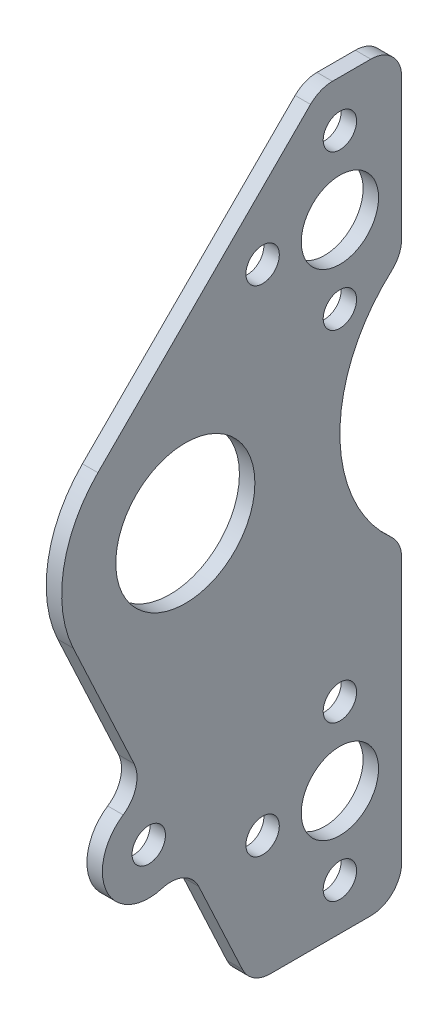
ISO-10303-21;
HEADER;
FILE_DESCRIPTION(('STEP AP214'),'2;1');
FILE_NAME('part.step','',(''),(''),'','','');
FILE_SCHEMA(('AUTOMOTIVE_DESIGN { 1 0 10303 214 1 1 1 1 }'));
ENDSEC;
DATA;
#1=APPLICATION_CONTEXT('core data for automotive mechanical design processes');
#2=APPLICATION_PROTOCOL_DEFINITION('international standard','automotive_design',2000,#1);
#3=PRODUCT_CONTEXT('',#1,'mechanical');
#4=PRODUCT('Part','Part','',(#3));
#5=PRODUCT_RELATED_PRODUCT_CATEGORY('part','',(#4));
#6=PRODUCT_DEFINITION_FORMATION('','',#4);
#7=PRODUCT_DEFINITION_CONTEXT('part definition',#1,'design');
#8=PRODUCT_DEFINITION('design','',#6,#7);
#9=PRODUCT_DEFINITION_SHAPE('','',#8);
#10=(LENGTH_UNIT() NAMED_UNIT(*) SI_UNIT(.MILLI.,.METRE.));
#11=(NAMED_UNIT(*) PLANE_ANGLE_UNIT() SI_UNIT($,.RADIAN.));
#12=(NAMED_UNIT(*) SI_UNIT($,.STERADIAN.) SOLID_ANGLE_UNIT());
#13=UNCERTAINTY_MEASURE_WITH_UNIT(LENGTH_MEASURE(1.E-05),#10,'distance_accuracy_value','');
#14=(GEOMETRIC_REPRESENTATION_CONTEXT(3) GLOBAL_UNCERTAINTY_ASSIGNED_CONTEXT((#13)) GLOBAL_UNIT_ASSIGNED_CONTEXT((#10,
#11,#12)) REPRESENTATION_CONTEXT('',''));
#15=CARTESIAN_POINT('',(0.,0.,0.));
#16=DIRECTION('',(0.,0.,1.));
#17=DIRECTION('',(1.,0.,0.));
#18=AXIS2_PLACEMENT_3D('',#15,#16,#17);
#19=CARTESIAN_POINT('',(3.175,-68.6728859953783,22.0595562798087));
#20=DIRECTION('',(1.,0.,0.));
#21=DIRECTION('',(0.,0.,-1.));
#22=AXIS2_PLACEMENT_3D('',#19,#20,#21);
#23=PLANE('',#22);
#24=CARTESIAN_POINT('',(3.175,-47.625,-12.7));
#25=DIRECTION('',(1.,0.,0.));
#26=DIRECTION('',(0.,0.,-1.));
#27=AXIS2_PLACEMENT_3D('',#24,#25,#26);
#28=CIRCLE('',#27,3.429);
#29=CARTESIAN_POINT('',(3.175,-47.625,-16.129));
#30=VERTEX_POINT('',#29);
#31=EDGE_CURVE('E456',#30,#30,#28,.T.);
#32=ORIENTED_EDGE('',*,*,#31,.F.);
#33=EDGE_LOOP('',(#32));
#34=FACE_BOUND('',#33,.T.);
#35=CARTESIAN_POINT('',(3.175,22.225,-12.7000000000002));
#36=DIRECTION('',(1.,0.,0.));
#37=DIRECTION('',(0.,0.,-1.));
#38=AXIS2_PLACEMENT_3D('',#35,#36,#37);
#39=CIRCLE('',#38,3.42899999999915);
#40=CARTESIAN_POINT('',(3.175,22.225,-16.1289999999993));
#41=VERTEX_POINT('',#40);
#42=EDGE_CURVE('E472',#41,#41,#39,.T.);
#43=ORIENTED_EDGE('',*,*,#42,.F.);
#44=EDGE_LOOP('',(#43));
#45=FACE_BOUND('',#44,.T.);
#46=CARTESIAN_POINT('',(3.175,53.9750000000001,-12.7000000000001));
#47=DIRECTION('',(1.,0.,0.));
#48=DIRECTION('',(0.,0.,-1.));
#49=AXIS2_PLACEMENT_3D('',#46,#47,#48);
#50=CIRCLE('',#49,3.42899999999915);
#51=CARTESIAN_POINT('',(3.175,53.9750000000001,-16.1289999999992));
#52=VERTEX_POINT('',#51);
#53=EDGE_CURVE('E488',#52,#52,#50,.T.);
#54=ORIENTED_EDGE('',*,*,#53,.F.);
#55=EDGE_LOOP('',(#54));
#56=FACE_BOUND('',#55,.T.);
#57=CARTESIAN_POINT('',(3.175,-63.5,-12.7));
#58=DIRECTION('',(1.,0.,0.));
#59=DIRECTION('',(0.,0.,-1.));
#60=AXIS2_PLACEMENT_3D('',#57,#58,#59);
#61=CIRCLE('',#60,7.93750000000001);
#62=CARTESIAN_POINT('',(3.175,-63.5,-20.6375));
#63=VERTEX_POINT('',#62);
#64=EDGE_CURVE('E504',#63,#63,#61,.T.);
#65=ORIENTED_EDGE('',*,*,#64,.F.);
#66=EDGE_LOOP('',(#65));
#67=FACE_BOUND('',#66,.T.);
#68=CARTESIAN_POINT('',(3.175,0.,19.05));
#69=DIRECTION('',(1.,0.,0.));
#70=DIRECTION('',(0.,0.,-1.));
#71=AXIS2_PLACEMENT_3D('',#68,#69,#70);
#72=CIRCLE('',#71,14.2875);
#73=CARTESIAN_POINT('',(3.175,0.,4.76250000000001));
#74=VERTEX_POINT('',#73);
#75=EDGE_CURVE('E210',#74,#74,#72,.T.);
#76=ORIENTED_EDGE('',*,*,#75,.F.);
#77=EDGE_LOOP('',(#76));
#78=FACE_BOUND('',#77,.T.);
#79=CARTESIAN_POINT('',(3.175,-68.6728859953783,22.0595562798087));
#80=DIRECTION('',(-1.,0.,0.));
#81=DIRECTION('',(0.,0.,-1.));
#82=AXIS2_PLACEMENT_3D('',#79,#80,#81);
#83=CIRCLE('',#82,6.35);
#84=CARTESIAN_POINT('',(3.175,-62.5836192013575,23.8604810176131));
#85=VERTEX_POINT('',#84);
#86=CARTESIAN_POINT('',(3.175,-65.9892600333248,16.304501832126));
#87=VERTEX_POINT('',#86);
#88=EDGE_CURVE('E258',#85,#87,#83,.T.);
#89=ORIENTED_EDGE('',*,*,#88,.T.);
#90=DIRECTION('',(0.,-0.906307787036648,-0.422618261740704));
#91=VECTOR('',#90,1.);
#92=CARTESIAN_POINT('',(3.175,-65.9892600333248,16.304501832126));
#93=LINE('',#92,#91);
#94=CARTESIAN_POINT('',(3.175,-85.2336259620534,7.33070662322261));
#95=VERTEX_POINT('',#94);
#96=EDGE_CURVE('E134',#87,#95,#93,.T.);
#97=ORIENTED_EDGE('',*,*,#96,.T.);
#98=CARTESIAN_POINT('',(3.175,-82.55,1.57565217553989));
#99=DIRECTION('',(1.,0.,0.));
#100=DIRECTION('',(0.,0.,-1.));
#101=AXIS2_PLACEMENT_3D('',#98,#99,#100);
#102=CIRCLE('',#101,6.34999999999999);
#103=CARTESIAN_POINT('',(3.175,-88.9,1.57565217553985));
#104=VERTEX_POINT('',#103);
#105=EDGE_CURVE('E319',#95,#104,#102,.T.);
#106=ORIENTED_EDGE('',*,*,#105,.T.);
#107=DIRECTION('',(0.,0.,-1.));
#108=VECTOR('',#107,1.);
#109=CARTESIAN_POINT('',(3.175,-88.9,-19.05));
#110=LINE('',#109,#108);
#111=CARTESIAN_POINT('',(3.175,-88.9,-19.05));
#112=VERTEX_POINT('',#111);
#113=EDGE_CURVE('E339',#104,#112,#110,.T.);
#114=ORIENTED_EDGE('',*,*,#113,.T.);
#115=CARTESIAN_POINT('',(3.175,-82.55,-19.05));
#116=DIRECTION('',(1.,0.,0.));
#117=DIRECTION('',(0.,0.,1.));
#118=AXIS2_PLACEMENT_3D('',#115,#116,#117);
#119=CIRCLE('',#118,6.35);
#120=CARTESIAN_POINT('',(3.175,-82.55,-25.4));
#121=VERTEX_POINT('',#120);
#122=EDGE_CURVE('E335',#112,#121,#119,.T.);
#123=ORIENTED_EDGE('',*,*,#122,.T.);
#124=DIRECTION('',(0.,1.,0.));
#125=VECTOR('',#124,1.);
#126=CARTESIAN_POINT('',(3.175,-28.3980633142473,-25.4));
#127=LINE('',#126,#125);
#128=CARTESIAN_POINT('',(3.175,-28.3980633142473,-25.4));
#129=VERTEX_POINT('',#128);
#130=EDGE_CURVE('E338',#121,#129,#127,.T.);
#131=ORIENTED_EDGE('',*,*,#130,.T.);
#132=CARTESIAN_POINT('',(3.175,-28.3980633142473,-19.05));
#133=DIRECTION('',(1.,0.,0.));
#134=DIRECTION('',(0.,0.,-1.));
#135=AXIS2_PLACEMENT_3D('',#132,#133,#134);
#136=CIRCLE('',#135,6.35);
#137=CARTESIAN_POINT('',(3.175,-23.6650527618728,-23.2833333333333));
#138=VERTEX_POINT('',#137);
#139=EDGE_CURVE('E343',#129,#138,#136,.T.);
#140=ORIENTED_EDGE('',*,*,#139,.T.);
#141=CARTESIAN_POINT('',(3.175,0.,-44.45));
#142=DIRECTION('',(-1.,0.,0.));
#143=DIRECTION('',(0.,0.,-1.));
#144=AXIS2_PLACEMENT_3D('',#141,#142,#143);
#145=CIRCLE('',#144,31.75);
#146=CARTESIAN_POINT('',(3.175,23.6650527618728,-23.2833333333333));
#147=VERTEX_POINT('',#146);
#148=EDGE_CURVE('E350',#138,#147,#145,.T.);
#149=ORIENTED_EDGE('',*,*,#148,.T.);
#150=CARTESIAN_POINT('',(3.175,28.3980633142473,-19.05));
#151=DIRECTION('',(1.,0.,0.));
#152=DIRECTION('',(0.,0.,1.));
#153=AXIS2_PLACEMENT_3D('',#150,#151,#152);
#154=CIRCLE('',#153,6.35);
#155=CARTESIAN_POINT('',(3.175,28.3980633142473,-25.4));
#156=VERTEX_POINT('',#155);
#157=EDGE_CURVE('E353',#147,#156,#154,.T.);
#158=ORIENTED_EDGE('',*,*,#157,.T.);
#159=DIRECTION('',(0.,1.,0.));
#160=VECTOR('',#159,1.);
#161=CARTESIAN_POINT('',(3.175,57.15,-25.4));
#162=LINE('',#161,#160);
#163=CARTESIAN_POINT('',(3.175,57.15,-25.4));
#164=VERTEX_POINT('',#163);
#165=EDGE_CURVE('E356',#156,#164,#162,.T.);
#166=ORIENTED_EDGE('',*,*,#165,.T.);
#167=CARTESIAN_POINT('',(3.175,57.15,-19.05));
#168=DIRECTION('',(1.,0.,0.));
#169=DIRECTION('',(0.,0.,-1.));
#170=AXIS2_PLACEMENT_3D('',#167,#168,#169);
#171=CIRCLE('',#170,6.35);
#172=CARTESIAN_POINT('',(3.175,63.5,-19.05));
#173=VERTEX_POINT('',#172);
#174=EDGE_CURVE('E359',#164,#173,#171,.T.);
#175=ORIENTED_EDGE('',*,*,#174,.T.);
#176=DIRECTION('',(0.,0.,1.));
#177=VECTOR('',#176,1.);
#178=CARTESIAN_POINT('',(3.175,63.5,-11.159231636793));
#179=LINE('',#178,#177);
#180=CARTESIAN_POINT('',(3.175,63.5,-11.159231636793));
#181=VERTEX_POINT('',#180);
#182=EDGE_CURVE('E362',#173,#181,#179,.T.);
#183=ORIENTED_EDGE('',*,*,#182,.T.);
#184=CARTESIAN_POINT('',(3.175,57.15,-11.159231636793));
#185=DIRECTION('',(1.,0.,0.));
#186=DIRECTION('',(0.,0.,1.));
#187=AXIS2_PLACEMENT_3D('',#184,#185,#186);
#188=CIRCLE('',#187,6.35000000000001);
#189=CARTESIAN_POINT('',(3.175,61.6401280605346,-6.66910357625844));
#190=VERTEX_POINT('',#189);
#191=EDGE_CURVE('E365',#181,#190,#188,.T.);
#192=ORIENTED_EDGE('',*,*,#191,.T.);
#193=DIRECTION('',(0.,-0.707106781186544,0.707106781186551));
#194=VECTOR('',#193,1.);
#195=CARTESIAN_POINT('',(3.175,17.9605122421384,37.0105122421382));
#196=LINE('',#195,#194);
#197=CARTESIAN_POINT('',(3.175,17.9605122421384,37.0105122421382));
#198=VERTEX_POINT('',#197);
#199=EDGE_CURVE('E368',#190,#198,#196,.T.);
#200=ORIENTED_EDGE('',*,*,#199,.T.);
#201=CARTESIAN_POINT('',(3.175,0.,19.05));
#202=DIRECTION('',(1.,0.,0.));
#203=DIRECTION('',(0.,0.,-1.));
#204=AXIS2_PLACEMENT_3D('',#201,#202,#203);
#205=CIRCLE('',#204,25.4);
#206=CARTESIAN_POINT('',(3.175,-10.7345038482139,42.0702177907309));
#207=VERTEX_POINT('',#206);
#208=EDGE_CURVE('E183',#198,#207,#205,.T.);
#209=ORIENTED_EDGE('',*,*,#208,.T.);
#210=DIRECTION('',(0.,-0.906307787036648,-0.422618261740704));
#211=VECTOR('',#210,1.);
#212=CARTESIAN_POINT('',(3.175,-10.7345038482139,42.0702177907309));
#213=LINE('',#212,#211);
#214=CARTESIAN_POINT('',(3.175,-37.531858960416,29.5744058836119));
#215=VERTEX_POINT('',#214);
#216=EDGE_CURVE('E177',#207,#215,#213,.T.);
#217=ORIENTED_EDGE('',*,*,#216,.T.);
#218=CARTESIAN_POINT('',(3.175,-40.2154849224695,35.3294603312946));
#219=DIRECTION('',(-1.,0.,0.));
#220=DIRECTION('',(0.,0.,-1.));
#221=AXIS2_PLACEMENT_3D('',#218,#219,#220);
#222=CIRCLE('',#221,6.35);
#223=CARTESIAN_POINT('',(3.175,-45.5091785576122,31.8224234485046));
#224=VERTEX_POINT('',#223);
#225=EDGE_CURVE('E181',#215,#224,#222,.T.);
#226=ORIENTED_EDGE('',*,*,#225,.T.);
#227=CARTESIAN_POINT('',(3.175,-53.4497190103263,26.5618681243196));
#228=DIRECTION('',(1.,0.,0.));
#229=DIRECTION('',(0.,0.,-1.));
#230=AXIS2_PLACEMENT_3D('',#227,#228,#229);
#231=CIRCLE('',#230,9.525);
#232=EDGE_CURVE('E61',#224,#85,#231,.T.);
#233=ORIENTED_EDGE('',*,*,#232,.T.);
#234=EDGE_LOOP('',(#89,#97,#106,#114,#123,#131,#140,#149,#158,#166,#175,#183,#192,#200,#209,
#217,#226,#233));
#235=FACE_BOUND('',#234,.T.);
#236=CARTESIAN_POINT('',(3.175,38.1000000000001,-12.7));
#237=DIRECTION('',(1.,0.,0.));
#238=DIRECTION('',(0.,0.,-1.));
#239=AXIS2_PLACEMENT_3D('',#236,#237,#238);
#240=CIRCLE('',#239,7.93750000000001);
#241=CARTESIAN_POINT('',(3.175,38.1000000000001,-20.6375));
#242=VERTEX_POINT('',#241);
#243=EDGE_CURVE('E512',#242,#242,#240,.T.);
#244=ORIENTED_EDGE('',*,*,#243,.F.);
#245=EDGE_LOOP('',(#244));
#246=FACE_BOUND('',#245,.T.);
#247=CARTESIAN_POINT('',(3.175,-53.4497190103263,26.5618681243196));
#248=DIRECTION('',(1.,0.,0.));
#249=DIRECTION('',(0.,0.,-1.));
#250=AXIS2_PLACEMENT_3D('',#247,#248,#249);
#251=CIRCLE('',#250,3.429);
#252=CARTESIAN_POINT('',(3.175,-53.4497190103263,23.1328681243196));
#253=VERTEX_POINT('',#252);
#254=EDGE_CURVE('E496',#253,#253,#251,.T.);
#255=ORIENTED_EDGE('',*,*,#254,.F.);
#256=EDGE_LOOP('',(#255));
#257=FACE_BOUND('',#256,.T.);
#258=CARTESIAN_POINT('',(3.175,38.1,3.17500000000001));
#259=DIRECTION('',(1.,0.,0.));
#260=DIRECTION('',(0.,0.,-1.));
#261=AXIS2_PLACEMENT_3D('',#258,#259,#260);
#262=CIRCLE('',#261,3.42899999999915);
#263=CARTESIAN_POINT('',(3.175,38.1,-0.253999999999145));
#264=VERTEX_POINT('',#263);
#265=EDGE_CURVE('E480',#264,#264,#262,.T.);
#266=ORIENTED_EDGE('',*,*,#265,.F.);
#267=EDGE_LOOP('',(#266));
#268=FACE_BOUND('',#267,.T.);
#269=CARTESIAN_POINT('',(3.175,-63.5,3.17499999999996));
#270=DIRECTION('',(1.,0.,0.));
#271=DIRECTION('',(0.,0.,-1.));
#272=AXIS2_PLACEMENT_3D('',#269,#270,#271);
#273=CIRCLE('',#272,3.429);
#274=CARTESIAN_POINT('',(3.175,-63.5,-0.25400000000004));
#275=VERTEX_POINT('',#274);
#276=EDGE_CURVE('E464',#275,#275,#273,.T.);
#277=ORIENTED_EDGE('',*,*,#276,.F.);
#278=EDGE_LOOP('',(#277));
#279=FACE_BOUND('',#278,.T.);
#280=CARTESIAN_POINT('',(3.175,-79.375,-12.7));
#281=DIRECTION('',(1.,0.,0.));
#282=DIRECTION('',(0.,0.,-1.));
#283=AXIS2_PLACEMENT_3D('',#280,#281,#282);
#284=CIRCLE('',#283,3.42900000000002);
#285=CARTESIAN_POINT('',(3.175,-79.375,-16.129));
#286=VERTEX_POINT('',#285);
#287=EDGE_CURVE('E445',#286,#286,#284,.T.);
#288=ORIENTED_EDGE('',*,*,#287,.F.);
#289=EDGE_LOOP('',(#288));
#290=FACE_BOUND('',#289,.T.);
#291=ADVANCED_FACE('F43',(#34,#45,#56,#67,#78,#235,#246,#257,#268,#279,#290),#23,.T.);
#292=CARTESIAN_POINT('',(0.,-68.6728859953783,22.0595562798087));
#293=DIRECTION('',(1.,0.,0.));
#294=DIRECTION('',(0.,0.,-1.));
#295=AXIS2_PLACEMENT_3D('',#292,#293,#294);
#296=PLANE('',#295);
#297=CARTESIAN_POINT('',(0.,-68.6728859953783,22.0595562798087));
#298=DIRECTION('',(-1.,0.,0.));
#299=DIRECTION('',(0.,0.,-1.));
#300=AXIS2_PLACEMENT_3D('',#297,#298,#299);
#301=CIRCLE('',#300,6.35);
#302=CARTESIAN_POINT('',(0.,-62.5836192013575,23.8604810176131));
#303=VERTEX_POINT('',#302);
#304=CARTESIAN_POINT('',(0.,-65.9892600333248,16.304501832126));
#305=VERTEX_POINT('',#304);
#306=EDGE_CURVE('E205',#303,#305,#301,.T.);
#307=ORIENTED_EDGE('',*,*,#306,.F.);
#308=CARTESIAN_POINT('',(0.,-53.4497190103263,26.5618681243196));
#309=DIRECTION('',(1.,0.,0.));
#310=DIRECTION('',(0.,0.,-1.));
#311=AXIS2_PLACEMENT_3D('',#308,#309,#310);
#312=CIRCLE('',#311,9.525);
#313=CARTESIAN_POINT('',(0.,-45.5091785576122,31.8224234485046));
#314=VERTEX_POINT('',#313);
#315=EDGE_CURVE('E126',#314,#303,#312,.T.);
#316=ORIENTED_EDGE('',*,*,#315,.F.);
#317=CARTESIAN_POINT('',(0.,-40.2154849224695,35.3294603312946));
#318=DIRECTION('',(-1.,0.,0.));
#319=DIRECTION('',(0.,0.,-1.));
#320=AXIS2_PLACEMENT_3D('',#317,#318,#319);
#321=CIRCLE('',#320,6.35);
#322=CARTESIAN_POINT('',(0.,-37.531858960416,29.5744058836119));
#323=VERTEX_POINT('',#322);
#324=EDGE_CURVE('E120',#323,#314,#321,.T.);
#325=ORIENTED_EDGE('',*,*,#324,.F.);
#326=DIRECTION('',(0.,-0.906307787036648,-0.422618261740704));
#327=VECTOR('',#326,1.);
#328=CARTESIAN_POINT('',(0.,-10.7345038482139,42.0702177907309));
#329=LINE('',#328,#327);
#330=CARTESIAN_POINT('',(0.,-10.7345038482139,42.0702177907309));
#331=VERTEX_POINT('',#330);
#332=EDGE_CURVE('E192',#331,#323,#329,.T.);
#333=ORIENTED_EDGE('',*,*,#332,.F.);
#334=CARTESIAN_POINT('',(0.,0.,19.05));
#335=DIRECTION('',(1.,0.,0.));
#336=DIRECTION('',(0.,0.,-1.));
#337=AXIS2_PLACEMENT_3D('',#334,#335,#336);
#338=CIRCLE('',#337,25.4);
#339=CARTESIAN_POINT('',(0.,17.9605122421384,37.0105122421382));
#340=VERTEX_POINT('',#339);
#341=EDGE_CURVE('E249',#340,#331,#338,.T.);
#342=ORIENTED_EDGE('',*,*,#341,.F.);
#343=DIRECTION('',(0.,-0.707106781186544,0.707106781186551));
#344=VECTOR('',#343,1.);
#345=CARTESIAN_POINT('',(0.,17.9605122421384,37.0105122421382));
#346=LINE('',#345,#344);
#347=CARTESIAN_POINT('',(0.,61.6401280605346,-6.66910357625844));
#348=VERTEX_POINT('',#347);
#349=EDGE_CURVE('E246',#348,#340,#346,.T.);
#350=ORIENTED_EDGE('',*,*,#349,.F.);
#351=CARTESIAN_POINT('',(0.,57.15,-11.159231636793));
#352=DIRECTION('',(1.,0.,0.));
#353=DIRECTION('',(0.,0.,1.));
#354=AXIS2_PLACEMENT_3D('',#351,#352,#353);
#355=CIRCLE('',#354,6.35000000000001);
#356=CARTESIAN_POINT('',(0.,63.5,-11.159231636793));
#357=VERTEX_POINT('',#356);
#358=EDGE_CURVE('E243',#357,#348,#355,.T.);
#359=ORIENTED_EDGE('',*,*,#358,.F.);
#360=DIRECTION('',(0.,0.,1.));
#361=VECTOR('',#360,1.);
#362=CARTESIAN_POINT('',(0.,63.5,-11.159231636793));
#363=LINE('',#362,#361);
#364=CARTESIAN_POINT('',(0.,63.5,-19.05));
#365=VERTEX_POINT('',#364);
#366=EDGE_CURVE('E240',#365,#357,#363,.T.);
#367=ORIENTED_EDGE('',*,*,#366,.F.);
#368=CARTESIAN_POINT('',(0.,57.15,-19.05));
#369=DIRECTION('',(1.,0.,0.));
#370=DIRECTION('',(0.,0.,-1.));
#371=AXIS2_PLACEMENT_3D('',#368,#369,#370);
#372=CIRCLE('',#371,6.35);
#373=CARTESIAN_POINT('',(0.,57.15,-25.4));
#374=VERTEX_POINT('',#373);
#375=EDGE_CURVE('E237',#374,#365,#372,.T.);
#376=ORIENTED_EDGE('',*,*,#375,.F.);
#377=DIRECTION('',(0.,1.,0.));
#378=VECTOR('',#377,1.);
#379=CARTESIAN_POINT('',(0.,57.15,-25.4));
#380=LINE('',#379,#378);
#381=CARTESIAN_POINT('',(0.,28.3980633142473,-25.4));
#382=VERTEX_POINT('',#381);
#383=EDGE_CURVE('E234',#382,#374,#380,.T.);
#384=ORIENTED_EDGE('',*,*,#383,.F.);
#385=CARTESIAN_POINT('',(0.,28.3980633142473,-19.05));
#386=DIRECTION('',(1.,0.,0.));
#387=DIRECTION('',(0.,0.,1.));
#388=AXIS2_PLACEMENT_3D('',#385,#386,#387);
#389=CIRCLE('',#388,6.35);
#390=CARTESIAN_POINT('',(0.,23.6650527618728,-23.2833333333333));
#391=VERTEX_POINT('',#390);
#392=EDGE_CURVE('E231',#391,#382,#389,.T.);
#393=ORIENTED_EDGE('',*,*,#392,.F.);
#394=CARTESIAN_POINT('',(0.,0.,-44.45));
#395=DIRECTION('',(-1.,0.,0.));
#396=DIRECTION('',(0.,0.,-1.));
#397=AXIS2_PLACEMENT_3D('',#394,#395,#396);
#398=CIRCLE('',#397,31.75);
#399=CARTESIAN_POINT('',(0.,-23.6650527618728,-23.2833333333333));
#400=VERTEX_POINT('',#399);
#401=EDGE_CURVE('E228',#400,#391,#398,.T.);
#402=ORIENTED_EDGE('',*,*,#401,.F.);
#403=CARTESIAN_POINT('',(0.,-28.3980633142473,-19.05));
#404=DIRECTION('',(1.,0.,0.));
#405=DIRECTION('',(0.,0.,-1.));
#406=AXIS2_PLACEMENT_3D('',#403,#404,#405);
#407=CIRCLE('',#406,6.35);
#408=CARTESIAN_POINT('',(0.,-28.3980633142473,-25.4));
#409=VERTEX_POINT('',#408);
#410=EDGE_CURVE('E225',#409,#400,#407,.T.);
#411=ORIENTED_EDGE('',*,*,#410,.F.);
#412=DIRECTION('',(0.,1.,0.));
#413=VECTOR('',#412,1.);
#414=CARTESIAN_POINT('',(0.,-28.3980633142473,-25.4));
#415=LINE('',#414,#413);
#416=CARTESIAN_POINT('',(0.,-82.55,-25.4));
#417=VERTEX_POINT('',#416);
#418=EDGE_CURVE('E222',#417,#409,#415,.T.);
#419=ORIENTED_EDGE('',*,*,#418,.F.);
#420=CARTESIAN_POINT('',(0.,-82.55,-19.05));
#421=DIRECTION('',(1.,0.,0.));
#422=DIRECTION('',(0.,0.,1.));
#423=AXIS2_PLACEMENT_3D('',#420,#421,#422);
#424=CIRCLE('',#423,6.35);
#425=CARTESIAN_POINT('',(0.,-88.9,-19.05));
#426=VERTEX_POINT('',#425);
#427=EDGE_CURVE('E219',#426,#417,#424,.T.);
#428=ORIENTED_EDGE('',*,*,#427,.F.);
#429=DIRECTION('',(0.,0.,-1.));
#430=VECTOR('',#429,1.);
#431=CARTESIAN_POINT('',(0.,-88.9,-19.05));
#432=LINE('',#431,#430);
#433=CARTESIAN_POINT('',(0.,-88.9,1.57565217553985));
#434=VERTEX_POINT('',#433);
#435=EDGE_CURVE('E216',#434,#426,#432,.T.);
#436=ORIENTED_EDGE('',*,*,#435,.F.);
#437=CARTESIAN_POINT('',(0.,-82.55,1.57565217553989));
#438=DIRECTION('',(1.,0.,0.));
#439=DIRECTION('',(0.,0.,-1.));
#440=AXIS2_PLACEMENT_3D('',#437,#438,#439);
#441=CIRCLE('',#440,6.34999999999999);
#442=CARTESIAN_POINT('',(0.,-85.2336259620534,7.33070662322261));
#443=VERTEX_POINT('',#442);
#444=EDGE_CURVE('E213',#443,#434,#441,.T.);
#445=ORIENTED_EDGE('',*,*,#444,.F.);
#446=DIRECTION('',(0.,-0.906307787036648,-0.422618261740704));
#447=VECTOR('',#446,1.);
#448=CARTESIAN_POINT('',(0.,-65.9892600333248,16.304501832126));
#449=LINE('',#448,#447);
#450=EDGE_CURVE('E209',#305,#443,#449,.T.);
#451=ORIENTED_EDGE('',*,*,#450,.F.);
#452=EDGE_LOOP('',(#307,#316,#325,#333,#342,#350,#359,#367,#376,#384,#393,#402,#411,#419,#428,
#436,#445,#451));
#453=FACE_BOUND('',#452,.T.);
#454=CARTESIAN_POINT('',(0.,0.,19.05));
#455=DIRECTION('',(1.,0.,0.));
#456=DIRECTION('',(0.,0.,-1.));
#457=AXIS2_PLACEMENT_3D('',#454,#455,#456);
#458=CIRCLE('',#457,14.2875);
#459=CARTESIAN_POINT('',(0.,0.,4.76250000000001));
#460=VERTEX_POINT('',#459);
#461=EDGE_CURVE('E516',#460,#460,#458,.T.);
#462=ORIENTED_EDGE('',*,*,#461,.T.);
#463=EDGE_LOOP('',(#462));
#464=FACE_BOUND('',#463,.T.);
#465=CARTESIAN_POINT('',(0.,38.1000000000001,-12.7));
#466=DIRECTION('',(1.,0.,0.));
#467=DIRECTION('',(0.,0.,-1.));
#468=AXIS2_PLACEMENT_3D('',#465,#466,#467);
#469=CIRCLE('',#468,7.93750000000001);
#470=CARTESIAN_POINT('',(0.,38.1000000000001,-20.6375));
#471=VERTEX_POINT('',#470);
#472=EDGE_CURVE('E508',#471,#471,#469,.T.);
#473=ORIENTED_EDGE('',*,*,#472,.T.);
#474=EDGE_LOOP('',(#473));
#475=FACE_BOUND('',#474,.T.);
#476=CARTESIAN_POINT('',(0.,-63.5,-12.7));
#477=DIRECTION('',(1.,0.,0.));
#478=DIRECTION('',(0.,0.,-1.));
#479=AXIS2_PLACEMENT_3D('',#476,#477,#478);
#480=CIRCLE('',#479,7.93750000000001);
#481=CARTESIAN_POINT('',(0.,-63.5,-20.6375));
#482=VERTEX_POINT('',#481);
#483=EDGE_CURVE('E500',#482,#482,#480,.T.);
#484=ORIENTED_EDGE('',*,*,#483,.T.);
#485=EDGE_LOOP('',(#484));
#486=FACE_BOUND('',#485,.T.);
#487=CARTESIAN_POINT('',(0.,-53.4497190103263,26.5618681243196));
#488=DIRECTION('',(1.,0.,0.));
#489=DIRECTION('',(0.,0.,-1.));
#490=AXIS2_PLACEMENT_3D('',#487,#488,#489);
#491=CIRCLE('',#490,3.429);
#492=CARTESIAN_POINT('',(0.,-53.4497190103263,23.1328681243196));
#493=VERTEX_POINT('',#492);
#494=EDGE_CURVE('E492',#493,#493,#491,.T.);
#495=ORIENTED_EDGE('',*,*,#494,.T.);
#496=EDGE_LOOP('',(#495));
#497=FACE_BOUND('',#496,.T.);
#498=CARTESIAN_POINT('',(0.,53.9750000000001,-12.7000000000001));
#499=DIRECTION('',(1.,0.,0.));
#500=DIRECTION('',(0.,0.,-1.));
#501=AXIS2_PLACEMENT_3D('',#498,#499,#500);
#502=CIRCLE('',#501,3.42899999999915);
#503=CARTESIAN_POINT('',(0.,53.9750000000001,-16.1289999999992));
#504=VERTEX_POINT('',#503);
#505=EDGE_CURVE('E484',#504,#504,#502,.T.);
#506=ORIENTED_EDGE('',*,*,#505,.T.);
#507=EDGE_LOOP('',(#506));
#508=FACE_BOUND('',#507,.T.);
#509=CARTESIAN_POINT('',(0.,38.1,3.17500000000001));
#510=DIRECTION('',(1.,0.,0.));
#511=DIRECTION('',(0.,0.,-1.));
#512=AXIS2_PLACEMENT_3D('',#509,#510,#511);
#513=CIRCLE('',#512,3.42899999999915);
#514=CARTESIAN_POINT('',(0.,38.1,-0.253999999999145));
#515=VERTEX_POINT('',#514);
#516=EDGE_CURVE('E476',#515,#515,#513,.T.);
#517=ORIENTED_EDGE('',*,*,#516,.T.);
#518=EDGE_LOOP('',(#517));
#519=FACE_BOUND('',#518,.T.);
#520=CARTESIAN_POINT('',(0.,22.225,-12.7000000000002));
#521=DIRECTION('',(1.,0.,0.));
#522=DIRECTION('',(0.,0.,-1.));
#523=AXIS2_PLACEMENT_3D('',#520,#521,#522);
#524=CIRCLE('',#523,3.42899999999915);
#525=CARTESIAN_POINT('',(0.,22.225,-16.1289999999993));
#526=VERTEX_POINT('',#525);
#527=EDGE_CURVE('E468',#526,#526,#524,.T.);
#528=ORIENTED_EDGE('',*,*,#527,.T.);
#529=EDGE_LOOP('',(#528));
#530=FACE_BOUND('',#529,.T.);
#531=CARTESIAN_POINT('',(0.,-63.5,3.17499999999996));
#532=DIRECTION('',(1.,0.,0.));
#533=DIRECTION('',(0.,0.,-1.));
#534=AXIS2_PLACEMENT_3D('',#531,#532,#533);
#535=CIRCLE('',#534,3.429);
#536=CARTESIAN_POINT('',(0.,-63.5,-0.25400000000004));
#537=VERTEX_POINT('',#536);
#538=EDGE_CURVE('E460',#537,#537,#535,.T.);
#539=ORIENTED_EDGE('',*,*,#538,.T.);
#540=EDGE_LOOP('',(#539));
#541=FACE_BOUND('',#540,.T.);
#542=CARTESIAN_POINT('',(0.,-47.625,-12.7));
#543=DIRECTION('',(1.,0.,0.));
#544=DIRECTION('',(0.,0.,-1.));
#545=AXIS2_PLACEMENT_3D('',#542,#543,#544);
#546=CIRCLE('',#545,3.429);
#547=CARTESIAN_POINT('',(0.,-47.625,-16.129));
#548=VERTEX_POINT('',#547);
#549=EDGE_CURVE('E453',#548,#548,#546,.T.);
#550=ORIENTED_EDGE('',*,*,#549,.T.);
#551=EDGE_LOOP('',(#550));
#552=FACE_BOUND('',#551,.T.);
#553=CARTESIAN_POINT('',(0.,-79.375,-12.7));
#554=DIRECTION('',(1.,0.,0.));
#555=DIRECTION('',(0.,0.,-1.));
#556=AXIS2_PLACEMENT_3D('',#553,#554,#555);
#557=CIRCLE('',#556,3.42900000000002);
#558=CARTESIAN_POINT('',(0.,-79.375,-16.129));
#559=VERTEX_POINT('',#558);
#560=EDGE_CURVE('E448',#559,#559,#557,.T.);
#561=ORIENTED_EDGE('',*,*,#560,.T.);
#562=EDGE_LOOP('',(#561));
#563=FACE_BOUND('',#562,.T.);
#564=ADVANCED_FACE('F323',(#453,#464,#475,#486,#497,#508,#519,#530,#541,#552,#563),#296,.F.);
#565=CARTESIAN_POINT('',(3.175,-68.6728859953783,22.0595562798087));
#566=DIRECTION('',(-1.,0.,0.));
#567=DIRECTION('',(0.,0.,1.));
#568=AXIS2_PLACEMENT_3D('',#565,#566,#567);
#569=CYLINDRICAL_SURFACE('',#568,6.35);
#570=ORIENTED_EDGE('',*,*,#306,.T.);
#571=DIRECTION('',(-1.,0.,0.));
#572=VECTOR('',#571,1.);
#573=CARTESIAN_POINT('',(3.175,-65.9892600333248,16.304501832126));
#574=LINE('',#573,#572);
#575=EDGE_CURVE('E11',#87,#305,#574,.T.);
#576=ORIENTED_EDGE('',*,*,#575,.F.);
#577=ORIENTED_EDGE('',*,*,#88,.F.);
#578=DIRECTION('',(-1.,0.,0.));
#579=VECTOR('',#578,1.);
#580=CARTESIAN_POINT('',(3.175,-62.5836192013575,23.8604810176131));
#581=LINE('',#580,#579);
#582=EDGE_CURVE('E201',#85,#303,#581,.T.);
#583=ORIENTED_EDGE('',*,*,#582,.T.);
#584=EDGE_LOOP('',(#570,#576,#577,#583));
#585=FACE_BOUND('',#584,.T.);
#586=ADVANCED_FACE('F45',(#585),#569,.F.);
#587=CARTESIAN_POINT('',(3.175,-65.9892600333248,16.304501832126));
#588=DIRECTION('',(0.,0.422618261740704,-0.906307787036648));
#589=DIRECTION('',(0.,0.906307787036648,0.422618261740704));
#590=AXIS2_PLACEMENT_3D('',#587,#588,#589);
#591=PLANE('',#590);
#592=ORIENTED_EDGE('',*,*,#450,.T.);
#593=DIRECTION('',(-1.,0.,0.));
#594=VECTOR('',#593,1.);
#595=CARTESIAN_POINT('',(3.175,-85.2336259620534,7.33070662322261));
#596=LINE('',#595,#594);
#597=EDGE_CURVE('E53',#95,#443,#596,.T.);
#598=ORIENTED_EDGE('',*,*,#597,.F.);
#599=ORIENTED_EDGE('',*,*,#96,.F.);
#600=ORIENTED_EDGE('',*,*,#575,.T.);
#601=EDGE_LOOP('',(#592,#598,#599,#600));
#602=FACE_BOUND('',#601,.T.);
#603=ADVANCED_FACE('F762',(#602),#591,.F.);
#604=CARTESIAN_POINT('',(3.175,-82.55,1.57565217553989));
#605=DIRECTION('',(-1.,0.,0.));
#606=DIRECTION('',(0.,0.,1.));
#607=AXIS2_PLACEMENT_3D('',#604,#605,#606);
#608=CYLINDRICAL_SURFACE('',#607,6.34999999999999);
#609=ORIENTED_EDGE('',*,*,#444,.T.);
#610=DIRECTION('',(-1.,0.,0.));
#611=VECTOR('',#610,1.);
#612=CARTESIAN_POINT('',(3.175,-88.9,1.57565217553985));
#613=LINE('',#612,#611);
#614=EDGE_CURVE('E309',#104,#434,#613,.T.);
#615=ORIENTED_EDGE('',*,*,#614,.F.);
#616=ORIENTED_EDGE('',*,*,#105,.F.);
#617=ORIENTED_EDGE('',*,*,#597,.T.);
#618=EDGE_LOOP('',(#609,#615,#616,#617));
#619=FACE_BOUND('',#618,.T.);
#620=ADVANCED_FACE('F317',(#619),#608,.T.);
#621=CARTESIAN_POINT('',(3.175,-88.9,-19.05));
#622=DIRECTION('',(0.,1.,0.));
#623=DIRECTION('',(0.,0.,1.));
#624=AXIS2_PLACEMENT_3D('',#621,#622,#623);
#625=PLANE('',#624);
#626=ORIENTED_EDGE('',*,*,#435,.T.);
#627=DIRECTION('',(-1.,0.,0.));
#628=VECTOR('',#627,1.);
#629=CARTESIAN_POINT('',(3.175,-88.9,-19.05));
#630=LINE('',#629,#628);
#631=EDGE_CURVE('E305',#112,#426,#630,.T.);
#632=ORIENTED_EDGE('',*,*,#631,.F.);
#633=ORIENTED_EDGE('',*,*,#113,.F.);
#634=ORIENTED_EDGE('',*,*,#614,.T.);
#635=EDGE_LOOP('',(#626,#632,#633,#634));
#636=FACE_BOUND('',#635,.T.);
#637=ADVANCED_FACE('F329',(#636),#625,.F.);
#638=CARTESIAN_POINT('',(3.175,-82.55,-19.05));
#639=DIRECTION('',(-1.,0.,0.));
#640=DIRECTION('',(0.,0.,1.));
#641=AXIS2_PLACEMENT_3D('',#638,#639,#640);
#642=CYLINDRICAL_SURFACE('',#641,6.35);
#643=ORIENTED_EDGE('',*,*,#427,.T.);
#644=DIRECTION('',(-1.,0.,0.));
#645=VECTOR('',#644,1.);
#646=CARTESIAN_POINT('',(3.175,-82.55,-25.4));
#647=LINE('',#646,#645);
#648=EDGE_CURVE('E301',#121,#417,#647,.T.);
#649=ORIENTED_EDGE('',*,*,#648,.F.);
#650=ORIENTED_EDGE('',*,*,#122,.F.);
#651=ORIENTED_EDGE('',*,*,#631,.T.);
#652=EDGE_LOOP('',(#643,#649,#650,#651));
#653=FACE_BOUND('',#652,.T.);
#654=ADVANCED_FACE('F333',(#653),#642,.T.);
#655=CARTESIAN_POINT('',(3.175,-28.3980633142473,-25.4));
#656=DIRECTION('',(0.,0.,1.));
#657=DIRECTION('',(0.,-1.,0.));
#658=AXIS2_PLACEMENT_3D('',#655,#656,#657);
#659=PLANE('',#658);
#660=ORIENTED_EDGE('',*,*,#418,.T.);
#661=DIRECTION('',(-1.,0.,0.));
#662=VECTOR('',#661,1.);
#663=CARTESIAN_POINT('',(3.175,-28.3980633142473,-25.4));
#664=LINE('',#663,#662);
#665=EDGE_CURVE('E297',#129,#409,#664,.T.);
#666=ORIENTED_EDGE('',*,*,#665,.F.);
#667=ORIENTED_EDGE('',*,*,#130,.F.);
#668=ORIENTED_EDGE('',*,*,#648,.T.);
#669=EDGE_LOOP('',(#660,#666,#667,#668));
#670=FACE_BOUND('',#669,.T.);
#671=ADVANCED_FACE('F723',(#670),#659,.F.);
#672=CARTESIAN_POINT('',(3.175,-28.3980633142473,-19.05));
#673=DIRECTION('',(-1.,0.,0.));
#674=DIRECTION('',(0.,0.,1.));
#675=AXIS2_PLACEMENT_3D('',#672,#673,#674);
#676=CYLINDRICAL_SURFACE('',#675,6.35);
#677=ORIENTED_EDGE('',*,*,#410,.T.);
#678=DIRECTION('',(-1.,0.,0.));
#679=VECTOR('',#678,1.);
#680=CARTESIAN_POINT('',(3.175,-23.6650527618728,-23.2833333333333));
#681=LINE('',#680,#679);
#682=EDGE_CURVE('E293',#138,#400,#681,.T.);
#683=ORIENTED_EDGE('',*,*,#682,.F.);
#684=ORIENTED_EDGE('',*,*,#139,.F.);
#685=ORIENTED_EDGE('',*,*,#665,.T.);
#686=EDGE_LOOP('',(#677,#683,#684,#685));
#687=FACE_BOUND('',#686,.T.);
#688=ADVANCED_FACE('F712',(#687),#676,.T.);
#689=CARTESIAN_POINT('',(3.175,0.,-44.45));
#690=DIRECTION('',(-1.,0.,0.));
#691=DIRECTION('',(0.,0.,1.));
#692=AXIS2_PLACEMENT_3D('',#689,#690,#691);
#693=CYLINDRICAL_SURFACE('',#692,31.75);
#694=ORIENTED_EDGE('',*,*,#401,.T.);
#695=DIRECTION('',(-1.,0.,0.));
#696=VECTOR('',#695,1.);
#697=CARTESIAN_POINT('',(3.175,23.6650527618728,-23.2833333333333));
#698=LINE('',#697,#696);
#699=EDGE_CURVE('E289',#147,#391,#698,.T.);
#700=ORIENTED_EDGE('',*,*,#699,.F.);
#701=ORIENTED_EDGE('',*,*,#148,.F.);
#702=ORIENTED_EDGE('',*,*,#682,.T.);
#703=EDGE_LOOP('',(#694,#700,#701,#702));
#704=FACE_BOUND('',#703,.T.);
#705=ADVANCED_FACE('F701',(#704),#693,.F.);
#706=CARTESIAN_POINT('',(3.175,28.3980633142473,-19.05));
#707=DIRECTION('',(-1.,0.,0.));
#708=DIRECTION('',(0.,0.,1.));
#709=AXIS2_PLACEMENT_3D('',#706,#707,#708);
#710=CYLINDRICAL_SURFACE('',#709,6.35);
#711=ORIENTED_EDGE('',*,*,#392,.T.);
#712=DIRECTION('',(-1.,0.,0.));
#713=VECTOR('',#712,1.);
#714=CARTESIAN_POINT('',(3.175,28.3980633142473,-25.4));
#715=LINE('',#714,#713);
#716=EDGE_CURVE('E285',#156,#382,#715,.T.);
#717=ORIENTED_EDGE('',*,*,#716,.F.);
#718=ORIENTED_EDGE('',*,*,#157,.F.);
#719=ORIENTED_EDGE('',*,*,#699,.T.);
#720=EDGE_LOOP('',(#711,#717,#718,#719));
#721=FACE_BOUND('',#720,.T.);
#722=ADVANCED_FACE('F690',(#721),#710,.T.);
#723=CARTESIAN_POINT('',(3.175,57.15,-25.4));
#724=DIRECTION('',(0.,0.,1.));
#725=DIRECTION('',(0.,-1.,0.));
#726=AXIS2_PLACEMENT_3D('',#723,#724,#725);
#727=PLANE('',#726);
#728=ORIENTED_EDGE('',*,*,#383,.T.);
#729=DIRECTION('',(-1.,0.,0.));
#730=VECTOR('',#729,1.);
#731=CARTESIAN_POINT('',(3.175,57.15,-25.4));
#732=LINE('',#731,#730);
#733=EDGE_CURVE('E281',#164,#374,#732,.T.);
#734=ORIENTED_EDGE('',*,*,#733,.F.);
#735=ORIENTED_EDGE('',*,*,#165,.F.);
#736=ORIENTED_EDGE('',*,*,#716,.T.);
#737=EDGE_LOOP('',(#728,#734,#735,#736));
#738=FACE_BOUND('',#737,.T.);
#739=ADVANCED_FACE('F679',(#738),#727,.F.);
#740=CARTESIAN_POINT('',(3.175,57.15,-19.05));
#741=DIRECTION('',(-1.,0.,0.));
#742=DIRECTION('',(0.,0.,1.));
#743=AXIS2_PLACEMENT_3D('',#740,#741,#742);
#744=CYLINDRICAL_SURFACE('',#743,6.35);
#745=ORIENTED_EDGE('',*,*,#375,.T.);
#746=DIRECTION('',(-1.,0.,0.));
#747=VECTOR('',#746,1.);
#748=CARTESIAN_POINT('',(3.175,63.5,-19.05));
#749=LINE('',#748,#747);
#750=EDGE_CURVE('E277',#173,#365,#749,.T.);
#751=ORIENTED_EDGE('',*,*,#750,.F.);
#752=ORIENTED_EDGE('',*,*,#174,.F.);
#753=ORIENTED_EDGE('',*,*,#733,.T.);
#754=EDGE_LOOP('',(#745,#751,#752,#753));
#755=FACE_BOUND('',#754,.T.);
#756=ADVANCED_FACE('F668',(#755),#744,.T.);
#757=CARTESIAN_POINT('',(3.175,63.5,-11.159231636793));
#758=DIRECTION('',(0.,-1.,0.));
#759=DIRECTION('',(0.,0.,-1.));
#760=AXIS2_PLACEMENT_3D('',#757,#758,#759);
#761=PLANE('',#760);
#762=ORIENTED_EDGE('',*,*,#366,.T.);
#763=DIRECTION('',(-1.,0.,0.));
#764=VECTOR('',#763,1.);
#765=CARTESIAN_POINT('',(3.175,63.5,-11.159231636793));
#766=LINE('',#765,#764);
#767=EDGE_CURVE('E273',#181,#357,#766,.T.);
#768=ORIENTED_EDGE('',*,*,#767,.F.);
#769=ORIENTED_EDGE('',*,*,#182,.F.);
#770=ORIENTED_EDGE('',*,*,#750,.T.);
#771=EDGE_LOOP('',(#762,#768,#769,#770));
#772=FACE_BOUND('',#771,.T.);
#773=ADVANCED_FACE('F657',(#772),#761,.F.);
#774=CARTESIAN_POINT('',(3.175,57.15,-11.159231636793));
#775=DIRECTION('',(-1.,0.,0.));
#776=DIRECTION('',(0.,0.,1.));
#777=AXIS2_PLACEMENT_3D('',#774,#775,#776);
#778=CYLINDRICAL_SURFACE('',#777,6.35000000000001);
#779=ORIENTED_EDGE('',*,*,#358,.T.);
#780=DIRECTION('',(-1.,0.,0.));
#781=VECTOR('',#780,1.);
#782=CARTESIAN_POINT('',(3.175,61.6401280605346,-6.66910357625844));
#783=LINE('',#782,#781);
#784=EDGE_CURVE('E269',#190,#348,#783,.T.);
#785=ORIENTED_EDGE('',*,*,#784,.F.);
#786=ORIENTED_EDGE('',*,*,#191,.F.);
#787=ORIENTED_EDGE('',*,*,#767,.T.);
#788=EDGE_LOOP('',(#779,#785,#786,#787));
#789=FACE_BOUND('',#788,.T.);
#790=ADVANCED_FACE('F647',(#789),#778,.T.);
#791=CARTESIAN_POINT('',(3.175,17.9605122421384,37.0105122421382));
#792=DIRECTION('',(0.,-0.707106781186551,-0.707106781186544));
#793=DIRECTION('',(0.,0.707106781186544,-0.707106781186551));
#794=AXIS2_PLACEMENT_3D('',#791,#792,#793);
#795=PLANE('',#794);
#796=ORIENTED_EDGE('',*,*,#349,.T.);
#797=DIRECTION('',(-1.,0.,0.));
#798=VECTOR('',#797,1.);
#799=CARTESIAN_POINT('',(3.175,17.9605122421384,37.0105122421382));
#800=LINE('',#799,#798);
#801=EDGE_CURVE('E265',#198,#340,#800,.T.);
#802=ORIENTED_EDGE('',*,*,#801,.F.);
#803=ORIENTED_EDGE('',*,*,#199,.F.);
#804=ORIENTED_EDGE('',*,*,#784,.T.);
#805=EDGE_LOOP('',(#796,#802,#803,#804));
#806=FACE_BOUND('',#805,.T.);
#807=ADVANCED_FACE('F376',(#806),#795,.F.);
#808=CARTESIAN_POINT('',(3.175,0.,19.05));
#809=DIRECTION('',(-1.,0.,0.));
#810=DIRECTION('',(0.,0.,1.));
#811=AXIS2_PLACEMENT_3D('',#808,#809,#810);
#812=CYLINDRICAL_SURFACE('',#811,25.4);
#813=ORIENTED_EDGE('',*,*,#341,.T.);
#814=DIRECTION('',(-1.,0.,0.));
#815=VECTOR('',#814,1.);
#816=CARTESIAN_POINT('',(3.175,-10.7345038482139,42.0702177907309));
#817=LINE('',#816,#815);
#818=EDGE_CURVE('E194',#207,#331,#817,.T.);
#819=ORIENTED_EDGE('',*,*,#818,.F.);
#820=ORIENTED_EDGE('',*,*,#208,.F.);
#821=ORIENTED_EDGE('',*,*,#801,.T.);
#822=EDGE_LOOP('',(#813,#819,#820,#821));
#823=FACE_BOUND('',#822,.T.);
#824=ADVANCED_FACE('F380',(#823),#812,.T.);
#825=CARTESIAN_POINT('',(3.175,-10.7345038482139,42.0702177907309));
#826=DIRECTION('',(0.,0.422618261740704,-0.906307787036648));
#827=DIRECTION('',(0.,0.906307787036648,0.422618261740704));
#828=AXIS2_PLACEMENT_3D('',#825,#826,#827);
#829=PLANE('',#828);
#830=ORIENTED_EDGE('',*,*,#332,.T.);
#831=DIRECTION('',(-1.,0.,0.));
#832=VECTOR('',#831,1.);
#833=CARTESIAN_POINT('',(3.175,-37.531858960416,29.5744058836119));
#834=LINE('',#833,#832);
#835=EDGE_CURVE('E189',#215,#323,#834,.T.);
#836=ORIENTED_EDGE('',*,*,#835,.F.);
#837=ORIENTED_EDGE('',*,*,#216,.F.);
#838=ORIENTED_EDGE('',*,*,#818,.T.);
#839=EDGE_LOOP('',(#830,#836,#837,#838));
#840=FACE_BOUND('',#839,.T.);
#841=ADVANCED_FACE('F190',(#840),#829,.F.);
#842=CARTESIAN_POINT('',(3.175,-40.2154849224695,35.3294603312946));
#843=DIRECTION('',(-1.,0.,0.));
#844=DIRECTION('',(0.,0.,1.));
#845=AXIS2_PLACEMENT_3D('',#842,#843,#844);
#846=CYLINDRICAL_SURFACE('',#845,6.35);
#847=ORIENTED_EDGE('',*,*,#324,.T.);
#848=DIRECTION('',(-1.,0.,0.));
#849=VECTOR('',#848,1.);
#850=CARTESIAN_POINT('',(3.175,-45.5091785576122,31.8224234485046));
#851=LINE('',#850,#849);
#852=EDGE_CURVE('E195',#224,#314,#851,.T.);
#853=ORIENTED_EDGE('',*,*,#852,.F.);
#854=ORIENTED_EDGE('',*,*,#225,.F.);
#855=ORIENTED_EDGE('',*,*,#835,.T.);
#856=EDGE_LOOP('',(#847,#853,#854,#855));
#857=FACE_BOUND('',#856,.T.);
#858=ADVANCED_FACE('F197',(#857),#846,.F.);
#859=CARTESIAN_POINT('',(3.175,-53.4497190103263,26.5618681243196));
#860=DIRECTION('',(-1.,0.,0.));
#861=DIRECTION('',(0.,0.,1.));
#862=AXIS2_PLACEMENT_3D('',#859,#860,#861);
#863=CYLINDRICAL_SURFACE('',#862,9.525);
#864=ORIENTED_EDGE('',*,*,#315,.T.);
#865=ORIENTED_EDGE('',*,*,#582,.F.);
#866=ORIENTED_EDGE('',*,*,#232,.F.);
#867=ORIENTED_EDGE('',*,*,#852,.T.);
#868=EDGE_LOOP('',(#864,#865,#866,#867));
#869=FACE_BOUND('',#868,.T.);
#870=ADVANCED_FACE('F384',(#869),#863,.T.);
#871=CARTESIAN_POINT('',(3.175,0.,19.05));
#872=DIRECTION('',(-1.,0.,0.));
#873=DIRECTION('',(0.,0.,1.));
#874=AXIS2_PLACEMENT_3D('',#871,#872,#873);
#875=CYLINDRICAL_SURFACE('',#874,14.2875);
#876=ORIENTED_EDGE('',*,*,#75,.T.);
#877=EDGE_LOOP('',(#876));
#878=FACE_BOUND('',#877,.T.);
#879=ORIENTED_EDGE('',*,*,#461,.F.);
#880=EDGE_LOOP('',(#879));
#881=FACE_BOUND('',#880,.T.);
#882=ADVANCED_FACE('F386',(#878,#881),#875,.F.);
#883=CARTESIAN_POINT('',(3.175,38.1000000000001,-12.7));
#884=DIRECTION('',(-1.,0.,0.));
#885=DIRECTION('',(0.,0.,1.));
#886=AXIS2_PLACEMENT_3D('',#883,#884,#885);
#887=CYLINDRICAL_SURFACE('',#886,7.93750000000001);
#888=ORIENTED_EDGE('',*,*,#243,.T.);
#889=EDGE_LOOP('',(#888));
#890=FACE_BOUND('',#889,.T.);
#891=ORIENTED_EDGE('',*,*,#472,.F.);
#892=EDGE_LOOP('',(#891));
#893=FACE_BOUND('',#892,.T.);
#894=ADVANCED_FACE('F392',(#890,#893),#887,.F.);
#895=CARTESIAN_POINT('',(3.175,-63.5,-12.7));
#896=DIRECTION('',(-1.,0.,0.));
#897=DIRECTION('',(0.,0.,1.));
#898=AXIS2_PLACEMENT_3D('',#895,#896,#897);
#899=CYLINDRICAL_SURFACE('',#898,7.93750000000001);
#900=ORIENTED_EDGE('',*,*,#64,.T.);
#901=EDGE_LOOP('',(#900));
#902=FACE_BOUND('',#901,.T.);
#903=ORIENTED_EDGE('',*,*,#483,.F.);
#904=EDGE_LOOP('',(#903));
#905=FACE_BOUND('',#904,.T.);
#906=ADVANCED_FACE('F408',(#902,#905),#899,.F.);
#907=CARTESIAN_POINT('',(3.175,-53.4497190103263,26.5618681243196));
#908=DIRECTION('',(-1.,0.,0.));
#909=DIRECTION('',(0.,0.,1.));
#910=AXIS2_PLACEMENT_3D('',#907,#908,#909);
#911=CYLINDRICAL_SURFACE('',#910,3.429);
#912=ORIENTED_EDGE('',*,*,#254,.T.);
#913=EDGE_LOOP('',(#912));
#914=FACE_BOUND('',#913,.T.);
#915=ORIENTED_EDGE('',*,*,#494,.F.);
#916=EDGE_LOOP('',(#915));
#917=FACE_BOUND('',#916,.T.);
#918=ADVANCED_FACE('F412',(#914,#917),#911,.F.);
#919=CARTESIAN_POINT('',(3.175,53.9750000000001,-12.7000000000001));
#920=DIRECTION('',(-1.,0.,0.));
#921=DIRECTION('',(0.,0.,1.));
#922=AXIS2_PLACEMENT_3D('',#919,#920,#921);
#923=CYLINDRICAL_SURFACE('',#922,3.42899999999915);
#924=ORIENTED_EDGE('',*,*,#53,.T.);
#925=EDGE_LOOP('',(#924));
#926=FACE_BOUND('',#925,.T.);
#927=ORIENTED_EDGE('',*,*,#505,.F.);
#928=EDGE_LOOP('',(#927));
#929=FACE_BOUND('',#928,.T.);
#930=ADVANCED_FACE('F416',(#926,#929),#923,.F.);
#931=CARTESIAN_POINT('',(3.175,38.1,3.17500000000001));
#932=DIRECTION('',(-1.,0.,0.));
#933=DIRECTION('',(0.,0.,1.));
#934=AXIS2_PLACEMENT_3D('',#931,#932,#933);
#935=CYLINDRICAL_SURFACE('',#934,3.42899999999915);
#936=ORIENTED_EDGE('',*,*,#265,.T.);
#937=EDGE_LOOP('',(#936));
#938=FACE_BOUND('',#937,.T.);
#939=ORIENTED_EDGE('',*,*,#516,.F.);
#940=EDGE_LOOP('',(#939));
#941=FACE_BOUND('',#940,.T.);
#942=ADVANCED_FACE('F420',(#938,#941),#935,.F.);
#943=CARTESIAN_POINT('',(3.175,22.225,-12.7000000000002));
#944=DIRECTION('',(-1.,0.,0.));
#945=DIRECTION('',(0.,0.,1.));
#946=AXIS2_PLACEMENT_3D('',#943,#944,#945);
#947=CYLINDRICAL_SURFACE('',#946,3.42899999999915);
#948=ORIENTED_EDGE('',*,*,#42,.T.);
#949=EDGE_LOOP('',(#948));
#950=FACE_BOUND('',#949,.T.);
#951=ORIENTED_EDGE('',*,*,#527,.F.);
#952=EDGE_LOOP('',(#951));
#953=FACE_BOUND('',#952,.T.);
#954=ADVANCED_FACE('F424',(#950,#953),#947,.F.);
#955=CARTESIAN_POINT('',(3.175,-63.5,3.17499999999996));
#956=DIRECTION('',(-1.,0.,0.));
#957=DIRECTION('',(0.,0.,1.));
#958=AXIS2_PLACEMENT_3D('',#955,#956,#957);
#959=CYLINDRICAL_SURFACE('',#958,3.429);
#960=ORIENTED_EDGE('',*,*,#276,.T.);
#961=EDGE_LOOP('',(#960));
#962=FACE_BOUND('',#961,.T.);
#963=ORIENTED_EDGE('',*,*,#538,.F.);
#964=EDGE_LOOP('',(#963));
#965=FACE_BOUND('',#964,.T.);
#966=ADVANCED_FACE('F428',(#962,#965),#959,.F.);
#967=CARTESIAN_POINT('',(3.175,-47.625,-12.7));
#968=DIRECTION('',(-1.,0.,0.));
#969=DIRECTION('',(0.,0.,1.));
#970=AXIS2_PLACEMENT_3D('',#967,#968,#969);
#971=CYLINDRICAL_SURFACE('',#970,3.429);
#972=ORIENTED_EDGE('',*,*,#31,.T.);
#973=EDGE_LOOP('',(#972));
#974=FACE_BOUND('',#973,.T.);
#975=ORIENTED_EDGE('',*,*,#549,.F.);
#976=EDGE_LOOP('',(#975));
#977=FACE_BOUND('',#976,.T.);
#978=ADVANCED_FACE('F432',(#974,#977),#971,.F.);
#979=CARTESIAN_POINT('',(3.175,-79.375,-12.7));
#980=DIRECTION('',(-1.,0.,0.));
#981=DIRECTION('',(0.,0.,1.));
#982=AXIS2_PLACEMENT_3D('',#979,#980,#981);
#983=CYLINDRICAL_SURFACE('',#982,3.42900000000002);
#984=ORIENTED_EDGE('',*,*,#287,.T.);
#985=EDGE_LOOP('',(#984));
#986=FACE_BOUND('',#985,.T.);
#987=ORIENTED_EDGE('',*,*,#560,.F.);
#988=EDGE_LOOP('',(#987));
#989=FACE_BOUND('',#988,.T.);
#990=ADVANCED_FACE('F436',(#986,#989),#983,.F.);
#991=CLOSED_SHELL('',(#291,#564,#586,#603,#620,#637,#654,#671,#688,#705,#722,#739,#756,#773,
#790,#807,#824,#841,#858,#870,#882,#894,#906,#918,#930,#942,#954,#966,#978,#990));
#992=MANIFOLD_SOLID_BREP('B2',#991);
#993=ADVANCED_BREP_SHAPE_REPRESENTATION('',(#18,#992),#14);
#994=SHAPE_DEFINITION_REPRESENTATION(#9,#993);
ENDSEC;
END-ISO-10303-21;
